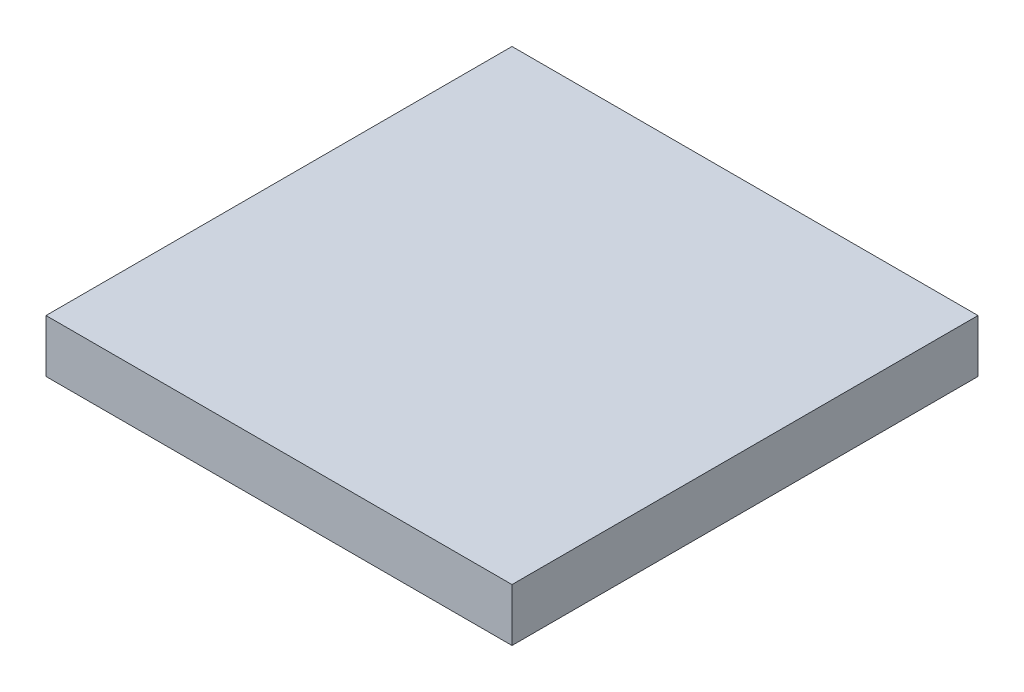
ISO-10303-21;
HEADER;
FILE_DESCRIPTION(('STEP AP214'),'2;1');
FILE_NAME('part.step','',(''),(''),'','','');
FILE_SCHEMA(('AUTOMOTIVE_DESIGN { 1 0 10303 214 1 1 1 1 }'));
ENDSEC;
DATA;
#1=APPLICATION_CONTEXT('core data for automotive mechanical design processes');
#2=APPLICATION_PROTOCOL_DEFINITION('international standard','automotive_design',2000,#1);
#3=PRODUCT_CONTEXT('',#1,'mechanical');
#4=PRODUCT('Part','Part','',(#3));
#5=PRODUCT_RELATED_PRODUCT_CATEGORY('part','',(#4));
#6=PRODUCT_DEFINITION_FORMATION('','',#4);
#7=PRODUCT_DEFINITION_CONTEXT('part definition',#1,'design');
#8=PRODUCT_DEFINITION('design','',#6,#7);
#9=PRODUCT_DEFINITION_SHAPE('','',#8);
#10=(LENGTH_UNIT() NAMED_UNIT(*) SI_UNIT(.MILLI.,.METRE.));
#11=(NAMED_UNIT(*) PLANE_ANGLE_UNIT() SI_UNIT($,.RADIAN.));
#12=(NAMED_UNIT(*) SI_UNIT($,.STERADIAN.) SOLID_ANGLE_UNIT());
#13=UNCERTAINTY_MEASURE_WITH_UNIT(LENGTH_MEASURE(1.E-05),#10,'distance_accuracy_value','');
#14=(GEOMETRIC_REPRESENTATION_CONTEXT(3) GLOBAL_UNCERTAINTY_ASSIGNED_CONTEXT((#13)) GLOBAL_UNIT_ASSIGNED_CONTEXT((#10,
#11,#12)) REPRESENTATION_CONTEXT('',''));
#15=CARTESIAN_POINT('',(0.,0.,0.));
#16=DIRECTION('',(0.,0.,1.));
#17=DIRECTION('',(1.,0.,0.));
#18=AXIS2_PLACEMENT_3D('',#15,#16,#17);
#19=CARTESIAN_POINT('',(-0.691304347826088,0.17,-0.710869565217391));
#20=DIRECTION('',(1.,0.,0.));
#21=DIRECTION('',(0.,0.,-1.));
#22=AXIS2_PLACEMENT_3D('',#19,#20,#21);
#23=PLANE('',#22);
#24=DIRECTION('',(0.,0.,1.));
#25=VECTOR('',#24,1.);
#26=CARTESIAN_POINT('',(-0.691304347826088,0.,-0.710869565217391));
#27=LINE('',#26,#25);
#28=CARTESIAN_POINT('',(-0.691304347826088,0.,-0.710869565217391));
#29=VERTEX_POINT('',#28);
#30=CARTESIAN_POINT('',(-0.691304347826087,0.,0.789130434782609));
#31=VERTEX_POINT('',#30);
#32=EDGE_CURVE('E97',#29,#31,#27,.T.);
#33=ORIENTED_EDGE('',*,*,#32,.T.);
#34=DIRECTION('',(0.,-1.,0.));
#35=VECTOR('',#34,1.);
#36=CARTESIAN_POINT('',(-0.691304347826087,0.17,0.789130434782609));
#37=LINE('',#36,#35);
#38=CARTESIAN_POINT('',(-0.691304347826087,0.17,0.789130434782609));
#39=VERTEX_POINT('',#38);
#40=EDGE_CURVE('E11',#39,#31,#37,.T.);
#41=ORIENTED_EDGE('',*,*,#40,.F.);
#42=DIRECTION('',(0.,0.,1.));
#43=VECTOR('',#42,1.);
#44=CARTESIAN_POINT('',(-0.691304347826088,0.17,-0.710869565217391));
#45=LINE('',#44,#43);
#46=CARTESIAN_POINT('',(-0.691304347826088,0.17,-0.710869565217391));
#47=VERTEX_POINT('',#46);
#48=EDGE_CURVE('E85',#47,#39,#45,.T.);
#49=ORIENTED_EDGE('',*,*,#48,.F.);
#50=DIRECTION('',(0.,-1.,0.));
#51=VECTOR('',#50,1.);
#52=CARTESIAN_POINT('',(-0.691304347826088,0.17,-0.710869565217391));
#53=LINE('',#52,#51);
#54=EDGE_CURVE('E93',#47,#29,#53,.T.);
#55=ORIENTED_EDGE('',*,*,#54,.T.);
#56=EDGE_LOOP('',(#33,#41,#49,#55));
#57=FACE_BOUND('',#56,.T.);
#58=ADVANCED_FACE('F34',(#57),#23,.F.);
#59=CARTESIAN_POINT('',(-0.691304347826087,0.17,0.789130434782609));
#60=DIRECTION('',(0.,0.,-1.));
#61=DIRECTION('',(-1.,0.,0.));
#62=AXIS2_PLACEMENT_3D('',#59,#60,#61);
#63=PLANE('',#62);
#64=DIRECTION('',(1.,0.,0.));
#65=VECTOR('',#64,1.);
#66=CARTESIAN_POINT('',(-0.691304347826087,0.,0.789130434782609));
#67=LINE('',#66,#65);
#68=CARTESIAN_POINT('',(0.808695652173913,0.,0.789130434782609));
#69=VERTEX_POINT('',#68);
#70=EDGE_CURVE('E89',#31,#69,#67,.T.);
#71=ORIENTED_EDGE('',*,*,#70,.T.);
#72=DIRECTION('',(0.,-1.,0.));
#73=VECTOR('',#72,1.);
#74=CARTESIAN_POINT('',(0.808695652173913,0.17,0.789130434782609));
#75=LINE('',#74,#73);
#76=CARTESIAN_POINT('',(0.808695652173913,0.17,0.789130434782609));
#77=VERTEX_POINT('',#76);
#78=EDGE_CURVE('E42',#77,#69,#75,.T.);
#79=ORIENTED_EDGE('',*,*,#78,.F.);
#80=DIRECTION('',(1.,0.,0.));
#81=VECTOR('',#80,1.);
#82=CARTESIAN_POINT('',(-0.691304347826087,0.17,0.789130434782609));
#83=LINE('',#82,#81);
#84=EDGE_CURVE('E80',#39,#77,#83,.T.);
#85=ORIENTED_EDGE('',*,*,#84,.F.);
#86=ORIENTED_EDGE('',*,*,#40,.T.);
#87=EDGE_LOOP('',(#71,#79,#85,#86));
#88=FACE_BOUND('',#87,.T.);
#89=ADVANCED_FACE('F88',(#88),#63,.F.);
#90=CARTESIAN_POINT('',(0.808695652173912,0.17,-0.710869565217391));
#91=DIRECTION('',(-1.,0.,0.));
#92=DIRECTION('',(0.,0.,1.));
#93=AXIS2_PLACEMENT_3D('',#90,#91,#92);
#94=PLANE('',#93);
#95=DIRECTION('',(0.,0.,-1.));
#96=VECTOR('',#95,1.);
#97=CARTESIAN_POINT('',(0.808695652173912,0.,-0.710869565217391));
#98=LINE('',#97,#96);
#99=CARTESIAN_POINT('',(0.808695652173912,0.,-0.710869565217391));
#100=VERTEX_POINT('',#99);
#101=EDGE_CURVE('E67',#69,#100,#98,.T.);
#102=ORIENTED_EDGE('',*,*,#101,.T.);
#103=DIRECTION('',(0.,-1.,0.));
#104=VECTOR('',#103,1.);
#105=CARTESIAN_POINT('',(0.808695652173912,0.17,-0.710869565217391));
#106=LINE('',#105,#104);
#107=CARTESIAN_POINT('',(0.808695652173912,0.17,-0.710869565217391));
#108=VERTEX_POINT('',#107);
#109=EDGE_CURVE('E90',#108,#100,#106,.T.);
#110=ORIENTED_EDGE('',*,*,#109,.F.);
#111=DIRECTION('',(0.,0.,-1.));
#112=VECTOR('',#111,1.);
#113=CARTESIAN_POINT('',(0.808695652173912,0.17,-0.710869565217391));
#114=LINE('',#113,#112);
#115=EDGE_CURVE('E83',#77,#108,#114,.T.);
#116=ORIENTED_EDGE('',*,*,#115,.F.);
#117=ORIENTED_EDGE('',*,*,#78,.T.);
#118=EDGE_LOOP('',(#102,#110,#116,#117));
#119=FACE_BOUND('',#118,.T.);
#120=ADVANCED_FACE('F91',(#119),#94,.F.);
#121=CARTESIAN_POINT('',(-0.691304347826088,0.17,-0.710869565217391));
#122=DIRECTION('',(0.,0.,1.));
#123=DIRECTION('',(1.,0.,0.));
#124=AXIS2_PLACEMENT_3D('',#121,#122,#123);
#125=PLANE('',#124);
#126=DIRECTION('',(-1.,0.,0.));
#127=VECTOR('',#126,1.);
#128=CARTESIAN_POINT('',(-0.691304347826088,0.,-0.710869565217391));
#129=LINE('',#128,#127);
#130=EDGE_CURVE('E73',#100,#29,#129,.T.);
#131=ORIENTED_EDGE('',*,*,#130,.T.);
#132=ORIENTED_EDGE('',*,*,#54,.F.);
#133=DIRECTION('',(-1.,0.,0.));
#134=VECTOR('',#133,1.);
#135=CARTESIAN_POINT('',(-0.691304347826088,0.17,-0.710869565217391));
#136=LINE('',#135,#134);
#137=EDGE_CURVE('E50',#108,#47,#136,.T.);
#138=ORIENTED_EDGE('',*,*,#137,.F.);
#139=ORIENTED_EDGE('',*,*,#109,.T.);
#140=EDGE_LOOP('',(#131,#132,#138,#139));
#141=FACE_BOUND('',#140,.T.);
#142=ADVANCED_FACE('F104',(#141),#125,.F.);
#143=CARTESIAN_POINT('',(0.,0.17,0.));
#144=DIRECTION('',(0.,1.,0.));
#145=DIRECTION('',(0.,0.,1.));
#146=AXIS2_PLACEMENT_3D('',#143,#144,#145);
#147=PLANE('',#146);
#148=ORIENTED_EDGE('',*,*,#48,.T.);
#149=ORIENTED_EDGE('',*,*,#84,.T.);
#150=ORIENTED_EDGE('',*,*,#115,.T.);
#151=ORIENTED_EDGE('',*,*,#137,.T.);
#152=EDGE_LOOP('',(#148,#149,#150,#151));
#153=FACE_BOUND('',#152,.T.);
#154=ADVANCED_FACE('F81',(#153),#147,.T.);
#155=CARTESIAN_POINT('',(0.,0.,0.));
#156=DIRECTION('',(0.,1.,0.));
#157=DIRECTION('',(0.,0.,1.));
#158=AXIS2_PLACEMENT_3D('',#155,#156,#157);
#159=PLANE('',#158);
#160=ORIENTED_EDGE('',*,*,#32,.F.);
#161=ORIENTED_EDGE('',*,*,#130,.F.);
#162=ORIENTED_EDGE('',*,*,#101,.F.);
#163=ORIENTED_EDGE('',*,*,#70,.F.);
#164=EDGE_LOOP('',(#160,#161,#162,#163));
#165=FACE_BOUND('',#164,.T.);
#166=ADVANCED_FACE('F107',(#165),#159,.F.);
#167=CLOSED_SHELL('',(#58,#89,#120,#142,#154,#166));
#168=MANIFOLD_SOLID_BREP('B2',#167);
#169=ADVANCED_BREP_SHAPE_REPRESENTATION('',(#18,#168),#14);
#170=SHAPE_DEFINITION_REPRESENTATION(#9,#169);
ENDSEC;
END-ISO-10303-21;
